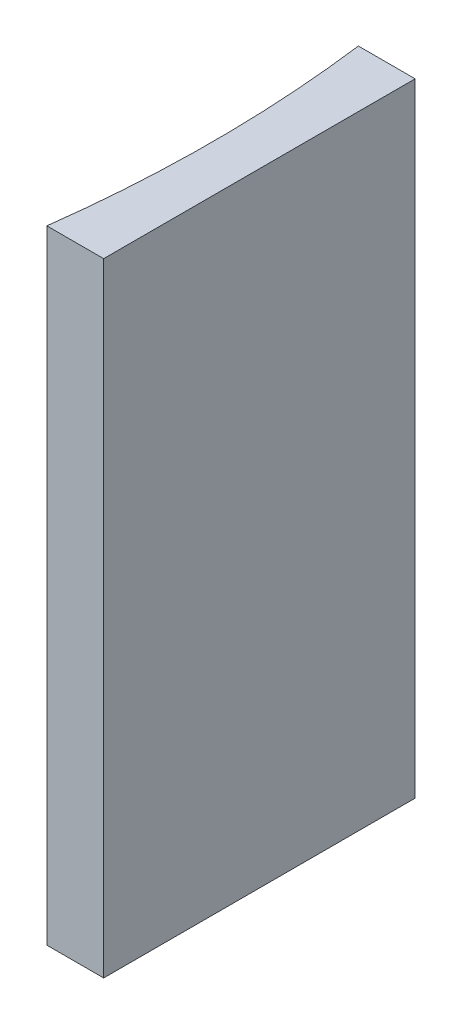
ISO-10303-21;
HEADER;
FILE_DESCRIPTION(('STEP AP214'),'2;1');
FILE_NAME('part.step','',(''),(''),'','','');
FILE_SCHEMA(('AUTOMOTIVE_DESIGN { 1 0 10303 214 1 1 1 1 }'));
ENDSEC;
DATA;
#1=APPLICATION_CONTEXT('core data for automotive mechanical design processes');
#2=APPLICATION_PROTOCOL_DEFINITION('international standard','automotive_design',2000,#1);
#3=PRODUCT_CONTEXT('',#1,'mechanical');
#4=PRODUCT('Part','Part','',(#3));
#5=PRODUCT_RELATED_PRODUCT_CATEGORY('part','',(#4));
#6=PRODUCT_DEFINITION_FORMATION('','',#4);
#7=PRODUCT_DEFINITION_CONTEXT('part definition',#1,'design');
#8=PRODUCT_DEFINITION('design','',#6,#7);
#9=PRODUCT_DEFINITION_SHAPE('','',#8);
#10=(LENGTH_UNIT() NAMED_UNIT(*) SI_UNIT(.MILLI.,.METRE.));
#11=(NAMED_UNIT(*) PLANE_ANGLE_UNIT() SI_UNIT($,.RADIAN.));
#12=(NAMED_UNIT(*) SI_UNIT($,.STERADIAN.) SOLID_ANGLE_UNIT());
#13=UNCERTAINTY_MEASURE_WITH_UNIT(LENGTH_MEASURE(1.E-05),#10,'distance_accuracy_value','');
#14=(GEOMETRIC_REPRESENTATION_CONTEXT(3) GLOBAL_UNCERTAINTY_ASSIGNED_CONTEXT((#13)) GLOBAL_UNIT_ASSIGNED_CONTEXT((#10,
#11,#12)) REPRESENTATION_CONTEXT('',''));
#15=CARTESIAN_POINT('',(0.,0.,0.));
#16=DIRECTION('',(0.,0.,1.));
#17=DIRECTION('',(1.,0.,0.));
#18=AXIS2_PLACEMENT_3D('',#15,#16,#17);
#19=CARTESIAN_POINT('',(0.,40.,0.));
#20=DIRECTION('',(0.,0.,1.));
#21=DIRECTION('',(1.,0.,0.));
#22=AXIS2_PLACEMENT_3D('',#19,#20,#21);
#23=PLANE('',#22);
#24=DIRECTION('',(-1.,0.,0.));
#25=VECTOR('',#24,1.);
#26=CARTESIAN_POINT('',(0.,0.,0.));
#27=LINE('',#26,#25);
#28=CARTESIAN_POINT('',(0.,0.,0.));
#29=VERTEX_POINT('',#28);
#30=CARTESIAN_POINT('',(-3.64744802673971,0.,0.));
#31=VERTEX_POINT('',#30);
#32=EDGE_CURVE('E100',#29,#31,#27,.T.);
#33=ORIENTED_EDGE('',*,*,#32,.T.);
#34=DIRECTION('',(0.,-1.,0.));
#35=VECTOR('',#34,1.);
#36=CARTESIAN_POINT('',(-3.64744802673971,40.,0.));
#37=LINE('',#36,#35);
#38=CARTESIAN_POINT('',(-3.64744802673971,40.,0.));
#39=VERTEX_POINT('',#38);
#40=EDGE_CURVE('E11',#39,#31,#37,.T.);
#41=ORIENTED_EDGE('',*,*,#40,.F.);
#42=DIRECTION('',(-1.,0.,0.));
#43=VECTOR('',#42,1.);
#44=CARTESIAN_POINT('',(0.,40.,0.));
#45=LINE('',#44,#43);
#46=CARTESIAN_POINT('',(0.,40.,0.));
#47=VERTEX_POINT('',#46);
#48=EDGE_CURVE('E88',#47,#39,#45,.T.);
#49=ORIENTED_EDGE('',*,*,#48,.F.);
#50=DIRECTION('',(0.,-1.,0.));
#51=VECTOR('',#50,1.);
#52=CARTESIAN_POINT('',(0.,40.,0.));
#53=LINE('',#52,#51);
#54=EDGE_CURVE('E96',#47,#29,#53,.T.);
#55=ORIENTED_EDGE('',*,*,#54,.T.);
#56=EDGE_LOOP('',(#33,#41,#49,#55));
#57=FACE_BOUND('',#56,.T.);
#58=ADVANCED_FACE('F37',(#57),#23,.F.);
#59=CARTESIAN_POINT('',(-80.55,40.,10.));
#60=DIRECTION('',(0.,-1.,0.));
#61=DIRECTION('',(0.,0.,-1.));
#62=AXIS2_PLACEMENT_3D('',#59,#60,#61);
#63=CYLINDRICAL_SURFACE('',#62,77.55);
#64=CARTESIAN_POINT('',(-80.55,0.,10.));
#65=DIRECTION('',(0.,-1.,0.));
#66=DIRECTION('',(0.,0.,1.));
#67=AXIS2_PLACEMENT_3D('',#64,#65,#66);
#68=CIRCLE('',#67,77.55);
#69=CARTESIAN_POINT('',(-3.6474480267397,0.,20.));
#70=VERTEX_POINT('',#69);
#71=EDGE_CURVE('E92',#31,#70,#68,.T.);
#72=ORIENTED_EDGE('',*,*,#71,.T.);
#73=DIRECTION('',(0.,-1.,0.));
#74=VECTOR('',#73,1.);
#75=CARTESIAN_POINT('',(-3.6474480267397,40.,20.));
#76=LINE('',#75,#74);
#77=CARTESIAN_POINT('',(-3.6474480267397,40.,20.));
#78=VERTEX_POINT('',#77);
#79=EDGE_CURVE('E45',#78,#70,#76,.T.);
#80=ORIENTED_EDGE('',*,*,#79,.F.);
#81=CARTESIAN_POINT('',(-80.55,40.,10.));
#82=DIRECTION('',(0.,-1.,0.));
#83=DIRECTION('',(0.,0.,1.));
#84=AXIS2_PLACEMENT_3D('',#81,#82,#83);
#85=CIRCLE('',#84,77.55);
#86=EDGE_CURVE('E83',#39,#78,#85,.T.);
#87=ORIENTED_EDGE('',*,*,#86,.F.);
#88=ORIENTED_EDGE('',*,*,#40,.T.);
#89=EDGE_LOOP('',(#72,#80,#87,#88));
#90=FACE_BOUND('',#89,.T.);
#91=ADVANCED_FACE('F91',(#90),#63,.F.);
#92=CARTESIAN_POINT('',(0.,40.,20.));
#93=DIRECTION('',(0.,0.,-1.));
#94=DIRECTION('',(-1.,0.,0.));
#95=AXIS2_PLACEMENT_3D('',#92,#93,#94);
#96=PLANE('',#95);
#97=DIRECTION('',(1.,0.,0.));
#98=VECTOR('',#97,1.);
#99=CARTESIAN_POINT('',(0.,0.,20.));
#100=LINE('',#99,#98);
#101=CARTESIAN_POINT('',(0.,0.,20.));
#102=VERTEX_POINT('',#101);
#103=EDGE_CURVE('E70',#70,#102,#100,.T.);
#104=ORIENTED_EDGE('',*,*,#103,.T.);
#105=DIRECTION('',(0.,-1.,0.));
#106=VECTOR('',#105,1.);
#107=CARTESIAN_POINT('',(0.,40.,20.));
#108=LINE('',#107,#106);
#109=CARTESIAN_POINT('',(0.,40.,20.));
#110=VERTEX_POINT('',#109);
#111=EDGE_CURVE('E93',#110,#102,#108,.T.);
#112=ORIENTED_EDGE('',*,*,#111,.F.);
#113=DIRECTION('',(1.,0.,0.));
#114=VECTOR('',#113,1.);
#115=CARTESIAN_POINT('',(0.,40.,20.));
#116=LINE('',#115,#114);
#117=EDGE_CURVE('E86',#78,#110,#116,.T.);
#118=ORIENTED_EDGE('',*,*,#117,.F.);
#119=ORIENTED_EDGE('',*,*,#79,.T.);
#120=EDGE_LOOP('',(#104,#112,#118,#119));
#121=FACE_BOUND('',#120,.T.);
#122=ADVANCED_FACE('F94',(#121),#96,.F.);
#123=CARTESIAN_POINT('',(0.,40.,0.));
#124=DIRECTION('',(-1.,0.,0.));
#125=DIRECTION('',(0.,0.,1.));
#126=AXIS2_PLACEMENT_3D('',#123,#124,#125);
#127=PLANE('',#126);
#128=DIRECTION('',(0.,0.,-1.));
#129=VECTOR('',#128,1.);
#130=CARTESIAN_POINT('',(0.,0.,0.));
#131=LINE('',#130,#129);
#132=EDGE_CURVE('E76',#102,#29,#131,.T.);
#133=ORIENTED_EDGE('',*,*,#132,.T.);
#134=ORIENTED_EDGE('',*,*,#54,.F.);
#135=DIRECTION('',(0.,0.,-1.));
#136=VECTOR('',#135,1.);
#137=CARTESIAN_POINT('',(0.,40.,0.));
#138=LINE('',#137,#136);
#139=EDGE_CURVE('E53',#110,#47,#138,.T.);
#140=ORIENTED_EDGE('',*,*,#139,.F.);
#141=ORIENTED_EDGE('',*,*,#111,.T.);
#142=EDGE_LOOP('',(#133,#134,#140,#141));
#143=FACE_BOUND('',#142,.T.);
#144=ADVANCED_FACE('F107',(#143),#127,.F.);
#145=CARTESIAN_POINT('',(-80.55,40.,10.));
#146=DIRECTION('',(0.,1.,0.));
#147=DIRECTION('',(0.,0.,1.));
#148=AXIS2_PLACEMENT_3D('',#145,#146,#147);
#149=PLANE('',#148);
#150=ORIENTED_EDGE('',*,*,#48,.T.);
#151=ORIENTED_EDGE('',*,*,#86,.T.);
#152=ORIENTED_EDGE('',*,*,#117,.T.);
#153=ORIENTED_EDGE('',*,*,#139,.T.);
#154=EDGE_LOOP('',(#150,#151,#152,#153));
#155=FACE_BOUND('',#154,.T.);
#156=ADVANCED_FACE('F84',(#155),#149,.T.);
#157=CARTESIAN_POINT('',(-80.55,0.,10.));
#158=DIRECTION('',(0.,1.,0.));
#159=DIRECTION('',(0.,0.,1.));
#160=AXIS2_PLACEMENT_3D('',#157,#158,#159);
#161=PLANE('',#160);
#162=ORIENTED_EDGE('',*,*,#32,.F.);
#163=ORIENTED_EDGE('',*,*,#132,.F.);
#164=ORIENTED_EDGE('',*,*,#103,.F.);
#165=ORIENTED_EDGE('',*,*,#71,.F.);
#166=EDGE_LOOP('',(#162,#163,#164,#165));
#167=FACE_BOUND('',#166,.T.);
#168=ADVANCED_FACE('F110',(#167),#161,.F.);
#169=CLOSED_SHELL('',(#58,#91,#122,#144,#156,#168));
#170=MANIFOLD_SOLID_BREP('B2',#169);
#171=ADVANCED_BREP_SHAPE_REPRESENTATION('',(#18,#170),#14);
#172=SHAPE_DEFINITION_REPRESENTATION(#9,#171);
ENDSEC;
END-ISO-10303-21;
